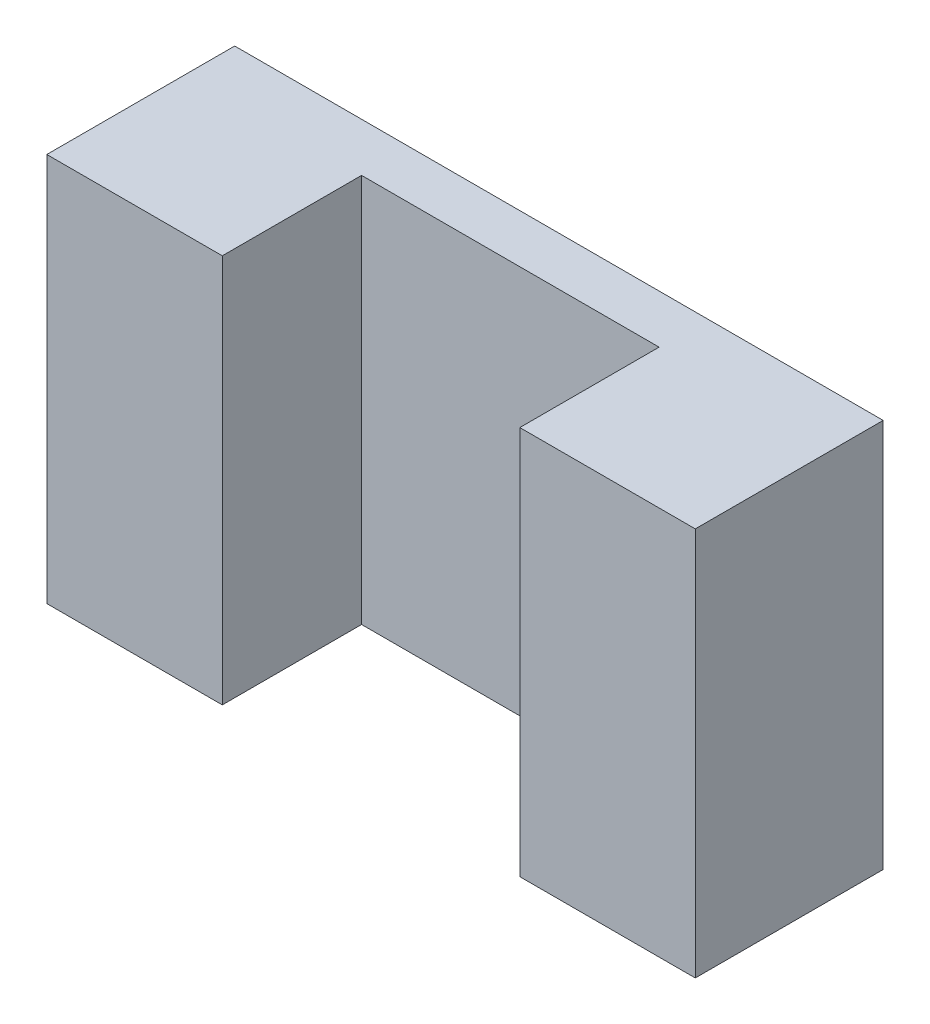
ISO-10303-21;
HEADER;
FILE_DESCRIPTION(('STEP AP214'),'2;1');
FILE_NAME('part.step','',(''),(''),'','','');
FILE_SCHEMA(('AUTOMOTIVE_DESIGN { 1 0 10303 214 1 1 1 1 }'));
ENDSEC;
DATA;
#1=APPLICATION_CONTEXT('core data for automotive mechanical design processes');
#2=APPLICATION_PROTOCOL_DEFINITION('international standard','automotive_design',2000,#1);
#3=PRODUCT_CONTEXT('',#1,'mechanical');
#4=PRODUCT('Part','Part','',(#3));
#5=PRODUCT_RELATED_PRODUCT_CATEGORY('part','',(#4));
#6=PRODUCT_DEFINITION_FORMATION('','',#4);
#7=PRODUCT_DEFINITION_CONTEXT('part definition',#1,'design');
#8=PRODUCT_DEFINITION('design','',#6,#7);
#9=PRODUCT_DEFINITION_SHAPE('','',#8);
#10=(LENGTH_UNIT() NAMED_UNIT(*) SI_UNIT(.MILLI.,.METRE.));
#11=(NAMED_UNIT(*) PLANE_ANGLE_UNIT() SI_UNIT($,.RADIAN.));
#12=(NAMED_UNIT(*) SI_UNIT($,.STERADIAN.) SOLID_ANGLE_UNIT());
#13=UNCERTAINTY_MEASURE_WITH_UNIT(LENGTH_MEASURE(1.E-05),#10,'distance_accuracy_value','');
#14=(GEOMETRIC_REPRESENTATION_CONTEXT(3) GLOBAL_UNCERTAINTY_ASSIGNED_CONTEXT((#13)) GLOBAL_UNIT_ASSIGNED_CONTEXT((#10,
#11,#12)) REPRESENTATION_CONTEXT('',''));
#15=CARTESIAN_POINT('',(0.,0.,0.));
#16=DIRECTION('',(0.,0.,1.));
#17=DIRECTION('',(1.,0.,0.));
#18=AXIS2_PLACEMENT_3D('',#15,#16,#17);
#19=CARTESIAN_POINT('',(-33.218726945,19.925,20.));
#20=DIRECTION('',(1.,0.,0.));
#21=DIRECTION('',(0.,1.,0.));
#22=AXIS2_PLACEMENT_3D('',#19,#20,#21);
#23=PLANE('',#22);
#24=DIRECTION('',(0.,-1.,0.));
#25=VECTOR('',#24,1.);
#26=CARTESIAN_POINT('',(-33.218726945,19.925,19.25));
#27=LINE('',#26,#25);
#28=CARTESIAN_POINT('',(-33.218726945,19.925,19.25));
#29=VERTEX_POINT('',#28);
#30=CARTESIAN_POINT('',(-33.218726945,-19.925,19.25));
#31=VERTEX_POINT('',#30);
#32=EDGE_CURVE('E95',#29,#31,#27,.T.);
#33=ORIENTED_EDGE('',*,*,#32,.F.);
#34=DIRECTION('',(0.,0.,-1.));
#35=VECTOR('',#34,1.);
#36=CARTESIAN_POINT('',(-33.218726945,19.925,20.));
#37=LINE('',#36,#35);
#38=CARTESIAN_POINT('',(-33.218726945,19.925,0.));
#39=VERTEX_POINT('',#38);
#40=EDGE_CURVE('E121',#29,#39,#37,.T.);
#41=ORIENTED_EDGE('',*,*,#40,.T.);
#42=DIRECTION('',(0.,-1.,0.));
#43=VECTOR('',#42,1.);
#44=CARTESIAN_POINT('',(-33.218726945,19.925,0.));
#45=LINE('',#44,#43);
#46=CARTESIAN_POINT('',(-33.218726945,-19.925,0.));
#47=VERTEX_POINT('',#46);
#48=EDGE_CURVE('E115',#39,#47,#45,.T.);
#49=ORIENTED_EDGE('',*,*,#48,.T.);
#50=DIRECTION('',(0.,0.,-1.));
#51=VECTOR('',#50,1.);
#52=CARTESIAN_POINT('',(-33.218726945,-19.925,20.));
#53=LINE('',#52,#51);
#54=EDGE_CURVE('E41',#31,#47,#53,.T.);
#55=ORIENTED_EDGE('',*,*,#54,.F.);
#56=EDGE_LOOP('',(#33,#41,#49,#55));
#57=FACE_BOUND('',#56,.T.);
#58=ADVANCED_FACE('F34',(#57),#23,.F.);
#59=CARTESIAN_POINT('',(33.218726945,-19.925,20.));
#60=DIRECTION('',(0.,1.,0.));
#61=DIRECTION('',(-1.,0.,0.));
#62=AXIS2_PLACEMENT_3D('',#59,#60,#61);
#63=PLANE('',#62);
#64=DIRECTION('',(1.,0.,0.));
#65=VECTOR('',#64,1.);
#66=CARTESIAN_POINT('',(-33.218726945,-19.925,19.25));
#67=LINE('',#66,#65);
#68=CARTESIAN_POINT('',(-15.24,-19.925,19.25));
#69=VERTEX_POINT('',#68);
#70=EDGE_CURVE('E48',#31,#69,#67,.T.);
#71=ORIENTED_EDGE('',*,*,#70,.F.);
#72=ORIENTED_EDGE('',*,*,#54,.T.);
#73=DIRECTION('',(1.,0.,0.));
#74=VECTOR('',#73,1.);
#75=CARTESIAN_POINT('',(33.218726945,-19.925,0.));
#76=LINE('',#75,#74);
#77=CARTESIAN_POINT('',(33.218726945,-19.925,0.));
#78=VERTEX_POINT('',#77);
#79=EDGE_CURVE('E129',#47,#78,#76,.T.);
#80=ORIENTED_EDGE('',*,*,#79,.T.);
#81=DIRECTION('',(0.,0.,-1.));
#82=VECTOR('',#81,1.);
#83=CARTESIAN_POINT('',(33.218726945,-19.925,20.));
#84=LINE('',#83,#82);
#85=CARTESIAN_POINT('',(33.218726945,-19.925,19.25));
#86=VERTEX_POINT('',#85);
#87=EDGE_CURVE('E116',#86,#78,#84,.T.);
#88=ORIENTED_EDGE('',*,*,#87,.F.);
#89=CARTESIAN_POINT('',(15.24,-19.925,19.25));
#90=VERTEX_POINT('',#89);
#91=EDGE_CURVE('E102',#90,#86,#67,.T.);
#92=ORIENTED_EDGE('',*,*,#91,.F.);
#93=DIRECTION('',(0.,0.,1.));
#94=VECTOR('',#93,1.);
#95=CARTESIAN_POINT('',(15.24,-19.925,4.98));
#96=LINE('',#95,#94);
#97=CARTESIAN_POINT('',(15.24,-19.925,4.98));
#98=VERTEX_POINT('',#97);
#99=EDGE_CURVE('E134',#98,#90,#96,.T.);
#100=ORIENTED_EDGE('',*,*,#99,.F.);
#101=DIRECTION('',(1.,0.,0.));
#102=VECTOR('',#101,1.);
#103=CARTESIAN_POINT('',(15.24,-19.925,4.98));
#104=LINE('',#103,#102);
#105=CARTESIAN_POINT('',(-15.24,-19.925,4.98));
#106=VERTEX_POINT('',#105);
#107=EDGE_CURVE('E148',#106,#98,#104,.T.);
#108=ORIENTED_EDGE('',*,*,#107,.F.);
#109=DIRECTION('',(0.,0.,1.));
#110=VECTOR('',#109,1.);
#111=CARTESIAN_POINT('',(-15.24,-19.925,4.98));
#112=LINE('',#111,#110);
#113=EDGE_CURVE('E110',#106,#69,#112,.T.);
#114=ORIENTED_EDGE('',*,*,#113,.T.);
#115=EDGE_LOOP('',(#71,#72,#80,#88,#92,#100,#108,#114));
#116=FACE_BOUND('',#115,.T.);
#117=ADVANCED_FACE('F106',(#116),#63,.F.);
#118=CARTESIAN_POINT('',(33.218726945,19.925,20.));
#119=DIRECTION('',(-1.,0.,0.));
#120=DIRECTION('',(0.,-1.,0.));
#121=AXIS2_PLACEMENT_3D('',#118,#119,#120);
#122=PLANE('',#121);
#123=DIRECTION('',(0.,1.,0.));
#124=VECTOR('',#123,1.);
#125=CARTESIAN_POINT('',(33.218726945,19.925,19.25));
#126=LINE('',#125,#124);
#127=CARTESIAN_POINT('',(33.218726945,19.925,19.25));
#128=VERTEX_POINT('',#127);
#129=EDGE_CURVE('E111',#86,#128,#126,.T.);
#130=ORIENTED_EDGE('',*,*,#129,.F.);
#131=ORIENTED_EDGE('',*,*,#87,.T.);
#132=DIRECTION('',(0.,1.,0.));
#133=VECTOR('',#132,1.);
#134=CARTESIAN_POINT('',(33.218726945,19.925,0.));
#135=LINE('',#134,#133);
#136=CARTESIAN_POINT('',(33.218726945,19.925,0.));
#137=VERTEX_POINT('',#136);
#138=EDGE_CURVE('E126',#78,#137,#135,.T.);
#139=ORIENTED_EDGE('',*,*,#138,.T.);
#140=DIRECTION('',(0.,0.,-1.));
#141=VECTOR('',#140,1.);
#142=CARTESIAN_POINT('',(33.218726945,19.925,20.));
#143=LINE('',#142,#141);
#144=EDGE_CURVE('E117',#128,#137,#143,.T.);
#145=ORIENTED_EDGE('',*,*,#144,.F.);
#146=EDGE_LOOP('',(#130,#131,#139,#145));
#147=FACE_BOUND('',#146,.T.);
#148=ADVANCED_FACE('F166',(#147),#122,.F.);
#149=CARTESIAN_POINT('',(33.218726945,19.925,20.));
#150=DIRECTION('',(0.,-1.,0.));
#151=DIRECTION('',(1.,0.,0.));
#152=AXIS2_PLACEMENT_3D('',#149,#150,#151);
#153=PLANE('',#152);
#154=DIRECTION('',(-1.,0.,0.));
#155=VECTOR('',#154,1.);
#156=CARTESIAN_POINT('',(-33.218726945,19.925,19.25));
#157=LINE('',#156,#155);
#158=CARTESIAN_POINT('',(15.24,19.925,19.25));
#159=VERTEX_POINT('',#158);
#160=EDGE_CURVE('E55',#128,#159,#157,.T.);
#161=ORIENTED_EDGE('',*,*,#160,.F.);
#162=ORIENTED_EDGE('',*,*,#144,.T.);
#163=DIRECTION('',(-1.,0.,0.));
#164=VECTOR('',#163,1.);
#165=CARTESIAN_POINT('',(33.218726945,19.925,0.));
#166=LINE('',#165,#164);
#167=EDGE_CURVE('E123',#137,#39,#166,.T.);
#168=ORIENTED_EDGE('',*,*,#167,.T.);
#169=ORIENTED_EDGE('',*,*,#40,.F.);
#170=CARTESIAN_POINT('',(-15.24,19.925,19.25));
#171=VERTEX_POINT('',#170);
#172=EDGE_CURVE('E98',#171,#29,#157,.T.);
#173=ORIENTED_EDGE('',*,*,#172,.F.);
#174=DIRECTION('',(0.,0.,1.));
#175=VECTOR('',#174,1.);
#176=CARTESIAN_POINT('',(-15.24,19.925,4.98));
#177=LINE('',#176,#175);
#178=CARTESIAN_POINT('',(-15.24,19.925,4.98));
#179=VERTEX_POINT('',#178);
#180=EDGE_CURVE('E132',#179,#171,#177,.T.);
#181=ORIENTED_EDGE('',*,*,#180,.F.);
#182=DIRECTION('',(-1.,0.,0.));
#183=VECTOR('',#182,1.);
#184=CARTESIAN_POINT('',(15.24,19.925,4.98));
#185=LINE('',#184,#183);
#186=CARTESIAN_POINT('',(15.24,19.925,4.98));
#187=VERTEX_POINT('',#186);
#188=EDGE_CURVE('E135',#187,#179,#185,.T.);
#189=ORIENTED_EDGE('',*,*,#188,.F.);
#190=DIRECTION('',(0.,0.,1.));
#191=VECTOR('',#190,1.);
#192=CARTESIAN_POINT('',(15.24,19.925,4.98));
#193=LINE('',#192,#191);
#194=EDGE_CURVE('E138',#187,#159,#193,.T.);
#195=ORIENTED_EDGE('',*,*,#194,.T.);
#196=EDGE_LOOP('',(#161,#162,#168,#169,#173,#181,#189,#195));
#197=FACE_BOUND('',#196,.T.);
#198=ADVANCED_FACE('F164',(#197),#153,.F.);
#199=CARTESIAN_POINT('',(-15.24,19.925,4.98));
#200=DIRECTION('',(-1.,0.,0.));
#201=DIRECTION('',(0.,0.,1.));
#202=AXIS2_PLACEMENT_3D('',#199,#200,#201);
#203=PLANE('',#202);
#204=DIRECTION('',(0.,1.,0.));
#205=VECTOR('',#204,1.);
#206=CARTESIAN_POINT('',(-15.24,19.925,19.25));
#207=LINE('',#206,#205);
#208=EDGE_CURVE('E154',#69,#171,#207,.T.);
#209=ORIENTED_EDGE('',*,*,#208,.F.);
#210=ORIENTED_EDGE('',*,*,#113,.F.);
#211=DIRECTION('',(0.,-1.,0.));
#212=VECTOR('',#211,1.);
#213=CARTESIAN_POINT('',(-15.24,19.925,4.98));
#214=LINE('',#213,#212);
#215=EDGE_CURVE('E151',#179,#106,#214,.T.);
#216=ORIENTED_EDGE('',*,*,#215,.F.);
#217=ORIENTED_EDGE('',*,*,#180,.T.);
#218=EDGE_LOOP('',(#209,#210,#216,#217));
#219=FACE_BOUND('',#218,.T.);
#220=ADVANCED_FACE('F173',(#219),#203,.F.);
#221=CARTESIAN_POINT('',(15.24,19.925,4.98));
#222=DIRECTION('',(1.,0.,0.));
#223=DIRECTION('',(0.,0.,-1.));
#224=AXIS2_PLACEMENT_3D('',#221,#222,#223);
#225=PLANE('',#224);
#226=DIRECTION('',(0.,-1.,0.));
#227=VECTOR('',#226,1.);
#228=CARTESIAN_POINT('',(15.24,19.925,19.25));
#229=LINE('',#228,#227);
#230=EDGE_CURVE('E11',#159,#90,#229,.T.);
#231=ORIENTED_EDGE('',*,*,#230,.F.);
#232=ORIENTED_EDGE('',*,*,#194,.F.);
#233=DIRECTION('',(0.,1.,0.));
#234=VECTOR('',#233,1.);
#235=CARTESIAN_POINT('',(15.24,19.925,4.98));
#236=LINE('',#235,#234);
#237=EDGE_CURVE('E145',#98,#187,#236,.T.);
#238=ORIENTED_EDGE('',*,*,#237,.F.);
#239=ORIENTED_EDGE('',*,*,#99,.T.);
#240=EDGE_LOOP('',(#231,#232,#238,#239));
#241=FACE_BOUND('',#240,.T.);
#242=ADVANCED_FACE('F178',(#241),#225,.F.);
#243=CARTESIAN_POINT('',(0.,0.,0.));
#244=DIRECTION('',(0.,0.,-1.));
#245=DIRECTION('',(-1.,0.,0.));
#246=AXIS2_PLACEMENT_3D('',#243,#244,#245);
#247=PLANE('',#246);
#248=ORIENTED_EDGE('',*,*,#48,.F.);
#249=ORIENTED_EDGE('',*,*,#167,.F.);
#250=ORIENTED_EDGE('',*,*,#138,.F.);
#251=ORIENTED_EDGE('',*,*,#79,.F.);
#252=EDGE_LOOP('',(#248,#249,#250,#251));
#253=FACE_BOUND('',#252,.T.);
#254=ADVANCED_FACE('F170',(#253),#247,.T.);
#255=CARTESIAN_POINT('',(0.,0.,4.98));
#256=DIRECTION('',(0.,0.,-1.));
#257=DIRECTION('',(-1.,0.,0.));
#258=AXIS2_PLACEMENT_3D('',#255,#256,#257);
#259=PLANE('',#258);
#260=ORIENTED_EDGE('',*,*,#215,.T.);
#261=ORIENTED_EDGE('',*,*,#107,.T.);
#262=ORIENTED_EDGE('',*,*,#237,.T.);
#263=ORIENTED_EDGE('',*,*,#188,.T.);
#264=EDGE_LOOP('',(#260,#261,#262,#263));
#265=FACE_BOUND('',#264,.T.);
#266=ADVANCED_FACE('F175',(#265),#259,.F.);
#267=CARTESIAN_POINT('',(0.,0.,19.25));
#268=DIRECTION('',(0.,0.,1.));
#269=DIRECTION('',(1.,0.,0.));
#270=AXIS2_PLACEMENT_3D('',#267,#268,#269);
#271=PLANE('',#270);
#272=ORIENTED_EDGE('',*,*,#230,.T.);
#273=ORIENTED_EDGE('',*,*,#91,.T.);
#274=ORIENTED_EDGE('',*,*,#129,.T.);
#275=ORIENTED_EDGE('',*,*,#160,.T.);
#276=EDGE_LOOP('',(#272,#273,#274,#275));
#277=FACE_BOUND('',#276,.T.);
#278=ADVANCED_FACE('F158',(#277),#271,.T.);
#279=ORIENTED_EDGE('',*,*,#208,.T.);
#280=ORIENTED_EDGE('',*,*,#172,.T.);
#281=ORIENTED_EDGE('',*,*,#32,.T.);
#282=ORIENTED_EDGE('',*,*,#70,.T.);
#283=EDGE_LOOP('',(#279,#280,#281,#282));
#284=FACE_BOUND('',#283,.T.);
#285=ADVANCED_FACE('F96',(#284),#271,.T.);
#286=CLOSED_SHELL('',(#58,#117,#148,#198,#220,#242,#254,#266,#278,#285));
#287=MANIFOLD_SOLID_BREP('B2',#286);
#288=ADVANCED_BREP_SHAPE_REPRESENTATION('',(#18,#287),#14);
#289=SHAPE_DEFINITION_REPRESENTATION(#9,#288);
ENDSEC;
END-ISO-10303-21;
